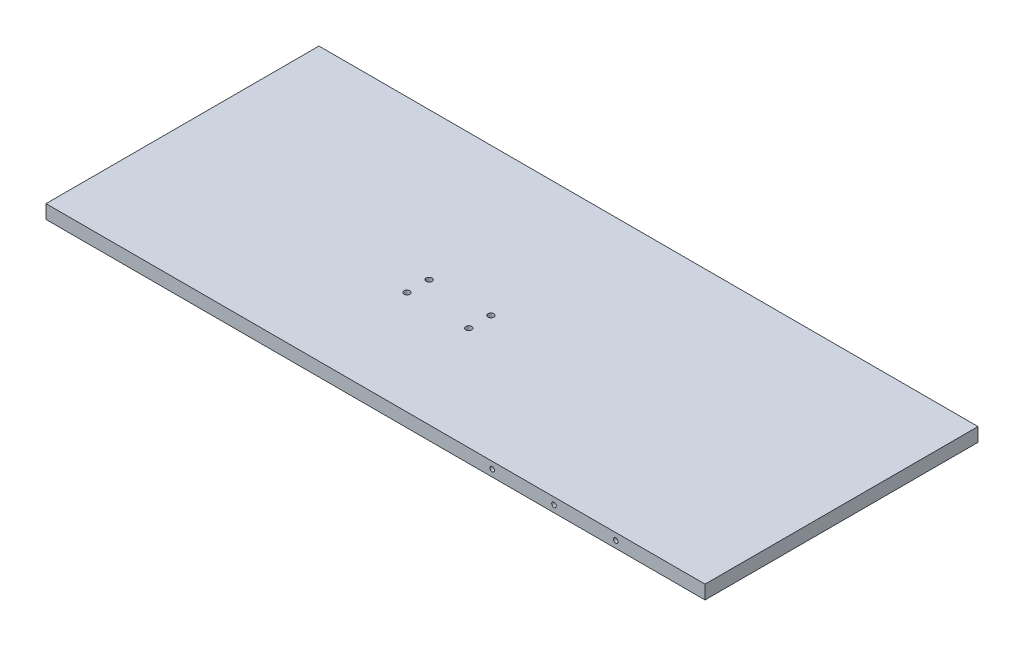
ISO-10303-21;
HEADER;
FILE_DESCRIPTION(('STEP AP214'),'2;1');
FILE_NAME('part.step','',(''),(''),'','','');
FILE_SCHEMA(('AUTOMOTIVE_DESIGN { 1 0 10303 214 1 1 1 1 }'));
ENDSEC;
DATA;
#1=APPLICATION_CONTEXT('core data for automotive mechanical design processes');
#2=APPLICATION_PROTOCOL_DEFINITION('international standard','automotive_design',2000,#1);
#3=PRODUCT_CONTEXT('',#1,'mechanical');
#4=PRODUCT('Part','Part','',(#3));
#5=PRODUCT_RELATED_PRODUCT_CATEGORY('part','',(#4));
#6=PRODUCT_DEFINITION_FORMATION('','',#4);
#7=PRODUCT_DEFINITION_CONTEXT('part definition',#1,'design');
#8=PRODUCT_DEFINITION('design','',#6,#7);
#9=PRODUCT_DEFINITION_SHAPE('','',#8);
#10=(LENGTH_UNIT() NAMED_UNIT(*) SI_UNIT(.MILLI.,.METRE.));
#11=(NAMED_UNIT(*) PLANE_ANGLE_UNIT() SI_UNIT($,.RADIAN.));
#12=(NAMED_UNIT(*) SI_UNIT($,.STERADIAN.) SOLID_ANGLE_UNIT());
#13=UNCERTAINTY_MEASURE_WITH_UNIT(LENGTH_MEASURE(1.E-05),#10,'distance_accuracy_value','');
#14=(GEOMETRIC_REPRESENTATION_CONTEXT(3) GLOBAL_UNCERTAINTY_ASSIGNED_CONTEXT((#13)) GLOBAL_UNIT_ASSIGNED_CONTEXT((#10,
#11,#12)) REPRESENTATION_CONTEXT('',''));
#15=CARTESIAN_POINT('',(0.,0.,0.));
#16=DIRECTION('',(0.,0.,1.));
#17=DIRECTION('',(1.,0.,0.));
#18=AXIS2_PLACEMENT_3D('',#15,#16,#17);
#19=CARTESIAN_POINT('',(0.,25.4,0.));
#20=DIRECTION('',(-1.,0.,0.));
#21=DIRECTION('',(0.,0.,1.));
#22=AXIS2_PLACEMENT_3D('',#19,#20,#21);
#23=PLANE('',#22);
#24=DIRECTION('',(0.,0.,-1.));
#25=VECTOR('',#24,1.);
#26=CARTESIAN_POINT('',(0.,0.,0.));
#27=LINE('',#26,#25);
#28=CARTESIAN_POINT('',(0.,0.,0.));
#29=VERTEX_POINT('',#28);
#30=CARTESIAN_POINT('',(0.,0.,-505.));
#31=VERTEX_POINT('',#30);
#32=EDGE_CURVE('E146',#29,#31,#27,.T.);
#33=ORIENTED_EDGE('',*,*,#32,.T.);
#34=DIRECTION('',(0.,-1.,0.));
#35=VECTOR('',#34,1.);
#36=CARTESIAN_POINT('',(0.,25.4,-505.));
#37=LINE('',#36,#35);
#38=CARTESIAN_POINT('',(0.,25.4,-505.));
#39=VERTEX_POINT('',#38);
#40=EDGE_CURVE('E11',#39,#31,#37,.T.);
#41=ORIENTED_EDGE('',*,*,#40,.F.);
#42=DIRECTION('',(0.,0.,-1.));
#43=VECTOR('',#42,1.);
#44=CARTESIAN_POINT('',(0.,25.4,0.));
#45=LINE('',#44,#43);
#46=CARTESIAN_POINT('',(0.,25.4,0.));
#47=VERTEX_POINT('',#46);
#48=EDGE_CURVE('E147',#47,#39,#45,.T.);
#49=ORIENTED_EDGE('',*,*,#48,.F.);
#50=DIRECTION('',(0.,-1.,0.));
#51=VECTOR('',#50,1.);
#52=CARTESIAN_POINT('',(0.,25.4,0.));
#53=LINE('',#52,#51);
#54=EDGE_CURVE('E153',#47,#29,#53,.T.);
#55=ORIENTED_EDGE('',*,*,#54,.T.);
#56=EDGE_LOOP('',(#33,#41,#49,#55));
#57=FACE_BOUND('',#56,.T.);
#58=ADVANCED_FACE('F33',(#57),#23,.F.);
#59=CARTESIAN_POINT('',(-1219.2,25.4,-505.));
#60=DIRECTION('',(0.,0.,1.));
#61=DIRECTION('',(1.,0.,0.));
#62=AXIS2_PLACEMENT_3D('',#59,#60,#61);
#63=PLANE('',#62);
#64=CARTESIAN_POINT('',(-165.1,12.7,-505.));
#65=DIRECTION('',(0.,0.,-1.));
#66=DIRECTION('',(-1.,0.,0.));
#67=AXIS2_PLACEMENT_3D('',#64,#65,#66);
#68=CIRCLE('',#67,4.24999999999998);
#69=CARTESIAN_POINT('',(-169.35,12.7,-505.));
#70=VERTEX_POINT('',#69);
#71=EDGE_CURVE('E110',#70,#70,#68,.T.);
#72=ORIENTED_EDGE('',*,*,#71,.F.);
#73=EDGE_LOOP('',(#72));
#74=FACE_BOUND('',#73,.T.);
#75=CARTESIAN_POINT('',(-279.4,12.7,-505.));
#76=DIRECTION('',(0.,0.,-1.));
#77=DIRECTION('',(-1.,0.,0.));
#78=AXIS2_PLACEMENT_3D('',#75,#76,#77);
#79=CIRCLE('',#78,4.24999999999998);
#80=CARTESIAN_POINT('',(-283.65,12.7,-505.));
#81=VERTEX_POINT('',#80);
#82=EDGE_CURVE('E109',#81,#81,#79,.T.);
#83=ORIENTED_EDGE('',*,*,#82,.F.);
#84=EDGE_LOOP('',(#83));
#85=FACE_BOUND('',#84,.T.);
#86=CARTESIAN_POINT('',(-393.7,12.7,-505.));
#87=DIRECTION('',(0.,0.,-1.));
#88=DIRECTION('',(-1.,0.,0.));
#89=AXIS2_PLACEMENT_3D('',#86,#87,#88);
#90=CIRCLE('',#89,4.24999999999998);
#91=CARTESIAN_POINT('',(-397.95,12.7,-505.));
#92=VERTEX_POINT('',#91);
#93=EDGE_CURVE('E122',#92,#92,#90,.T.);
#94=ORIENTED_EDGE('',*,*,#93,.F.);
#95=EDGE_LOOP('',(#94));
#96=FACE_BOUND('',#95,.T.);
#97=DIRECTION('',(-1.,0.,0.));
#98=VECTOR('',#97,1.);
#99=CARTESIAN_POINT('',(-1219.2,0.,-505.));
#100=LINE('',#99,#98);
#101=CARTESIAN_POINT('',(-1219.2,0.,-505.));
#102=VERTEX_POINT('',#101);
#103=EDGE_CURVE('E156',#31,#102,#100,.T.);
#104=ORIENTED_EDGE('',*,*,#103,.T.);
#105=DIRECTION('',(0.,-1.,0.));
#106=VECTOR('',#105,1.);
#107=CARTESIAN_POINT('',(-1219.2,25.4,-505.));
#108=LINE('',#107,#106);
#109=CARTESIAN_POINT('',(-1219.2,25.4,-505.));
#110=VERTEX_POINT('',#109);
#111=EDGE_CURVE('E41',#110,#102,#108,.T.);
#112=ORIENTED_EDGE('',*,*,#111,.F.);
#113=DIRECTION('',(-1.,0.,0.));
#114=VECTOR('',#113,1.);
#115=CARTESIAN_POINT('',(-1219.2,25.4,-505.));
#116=LINE('',#115,#114);
#117=EDGE_CURVE('E80',#39,#110,#116,.T.);
#118=ORIENTED_EDGE('',*,*,#117,.F.);
#119=ORIENTED_EDGE('',*,*,#40,.T.);
#120=EDGE_LOOP('',(#104,#112,#118,#119));
#121=FACE_BOUND('',#120,.T.);
#122=ADVANCED_FACE('F182',(#74,#85,#96,#121),#63,.F.);
#123=CARTESIAN_POINT('',(-1219.2,25.4,0.));
#124=DIRECTION('',(1.,0.,0.));
#125=DIRECTION('',(0.,0.,-1.));
#126=AXIS2_PLACEMENT_3D('',#123,#124,#125);
#127=PLANE('',#126);
#128=DIRECTION('',(0.,0.,1.));
#129=VECTOR('',#128,1.);
#130=CARTESIAN_POINT('',(-1219.2,0.,0.));
#131=LINE('',#130,#129);
#132=CARTESIAN_POINT('',(-1219.2,0.,0.));
#133=VERTEX_POINT('',#132);
#134=EDGE_CURVE('E67',#102,#133,#131,.T.);
#135=ORIENTED_EDGE('',*,*,#134,.T.);
#136=DIRECTION('',(0.,-1.,0.));
#137=VECTOR('',#136,1.);
#138=CARTESIAN_POINT('',(-1219.2,25.4,0.));
#139=LINE('',#138,#137);
#140=CARTESIAN_POINT('',(-1219.2,25.4,0.));
#141=VERTEX_POINT('',#140);
#142=EDGE_CURVE('E161',#141,#133,#139,.T.);
#143=ORIENTED_EDGE('',*,*,#142,.F.);
#144=DIRECTION('',(0.,0.,1.));
#145=VECTOR('',#144,1.);
#146=CARTESIAN_POINT('',(-1219.2,25.4,0.));
#147=LINE('',#146,#145);
#148=EDGE_CURVE('E150',#110,#141,#147,.T.);
#149=ORIENTED_EDGE('',*,*,#148,.F.);
#150=ORIENTED_EDGE('',*,*,#111,.T.);
#151=EDGE_LOOP('',(#135,#143,#149,#150));
#152=FACE_BOUND('',#151,.T.);
#153=ADVANCED_FACE('F163',(#152),#127,.F.);
#154=CARTESIAN_POINT('',(-1219.2,25.4,0.));
#155=DIRECTION('',(0.,0.,-1.));
#156=DIRECTION('',(-1.,0.,0.));
#157=AXIS2_PLACEMENT_3D('',#154,#155,#156);
#158=PLANE('',#157);
#159=CARTESIAN_POINT('',(-393.7,12.7,0.));
#160=DIRECTION('',(0.,0.,1.));
#161=DIRECTION('',(1.,0.,0.));
#162=AXIS2_PLACEMENT_3D('',#159,#160,#161);
#163=CIRCLE('',#162,4.24999999999998);
#164=CARTESIAN_POINT('',(-389.45,12.7,0.));
#165=VERTEX_POINT('',#164);
#166=EDGE_CURVE('E128',#165,#165,#163,.T.);
#167=ORIENTED_EDGE('',*,*,#166,.F.);
#168=EDGE_LOOP('',(#167));
#169=FACE_BOUND('',#168,.T.);
#170=CARTESIAN_POINT('',(-279.4,12.7,0.));
#171=DIRECTION('',(0.,0.,1.));
#172=DIRECTION('',(1.,0.,0.));
#173=AXIS2_PLACEMENT_3D('',#170,#171,#172);
#174=CIRCLE('',#173,4.24999999999998);
#175=CARTESIAN_POINT('',(-275.15,12.7,0.));
#176=VERTEX_POINT('',#175);
#177=EDGE_CURVE('E134',#176,#176,#174,.T.);
#178=ORIENTED_EDGE('',*,*,#177,.F.);
#179=EDGE_LOOP('',(#178));
#180=FACE_BOUND('',#179,.T.);
#181=CARTESIAN_POINT('',(-165.1,12.7,0.));
#182=DIRECTION('',(0.,0.,1.));
#183=DIRECTION('',(1.,0.,0.));
#184=AXIS2_PLACEMENT_3D('',#181,#182,#183);
#185=CIRCLE('',#184,4.25);
#186=CARTESIAN_POINT('',(-160.85,12.7,0.));
#187=VERTEX_POINT('',#186);
#188=EDGE_CURVE('E140',#187,#187,#185,.T.);
#189=ORIENTED_EDGE('',*,*,#188,.F.);
#190=EDGE_LOOP('',(#189));
#191=FACE_BOUND('',#190,.T.);
#192=DIRECTION('',(1.,0.,0.));
#193=VECTOR('',#192,1.);
#194=CARTESIAN_POINT('',(-1219.2,0.,0.));
#195=LINE('',#194,#193);
#196=EDGE_CURVE('E73',#133,#29,#195,.T.);
#197=ORIENTED_EDGE('',*,*,#196,.T.);
#198=ORIENTED_EDGE('',*,*,#54,.F.);
#199=DIRECTION('',(1.,0.,0.));
#200=VECTOR('',#199,1.);
#201=CARTESIAN_POINT('',(-1219.2,25.4,0.));
#202=LINE('',#201,#200);
#203=EDGE_CURVE('E49',#141,#47,#202,.T.);
#204=ORIENTED_EDGE('',*,*,#203,.F.);
#205=ORIENTED_EDGE('',*,*,#142,.T.);
#206=EDGE_LOOP('',(#197,#198,#204,#205));
#207=FACE_BOUND('',#206,.T.);
#208=ADVANCED_FACE('F170',(#169,#180,#191,#207),#158,.F.);
#209=CARTESIAN_POINT('',(0.,25.4,0.));
#210=DIRECTION('',(0.,-1.,0.));
#211=DIRECTION('',(0.,0.,-1.));
#212=AXIS2_PLACEMENT_3D('',#209,#210,#211);
#213=PLANE('',#212);
#214=CARTESIAN_POINT('',(-628.6,25.4,-191.600000000001));
#215=DIRECTION('',(0.,1.,0.));
#216=DIRECTION('',(0.,0.,1.));
#217=AXIS2_PLACEMENT_3D('',#214,#215,#216);
#218=CIRCLE('',#217,5.49999999999995);
#219=CARTESIAN_POINT('',(-628.6,25.4,-186.100000000001));
#220=VERTEX_POINT('',#219);
#221=EDGE_CURVE('E273',#220,#220,#218,.T.);
#222=ORIENTED_EDGE('',*,*,#221,.F.);
#223=EDGE_LOOP('',(#222));
#224=FACE_BOUND('',#223,.T.);
#225=CARTESIAN_POINT('',(-628.6,25.4,-232.500000000001));
#226=DIRECTION('',(0.,1.,0.));
#227=DIRECTION('',(0.,0.,1.));
#228=AXIS2_PLACEMENT_3D('',#225,#226,#227);
#229=CIRCLE('',#228,5.49999999999995);
#230=CARTESIAN_POINT('',(-628.6,25.4,-227.000000000001));
#231=VERTEX_POINT('',#230);
#232=EDGE_CURVE('E269',#231,#231,#229,.T.);
#233=ORIENTED_EDGE('',*,*,#232,.F.);
#234=EDGE_LOOP('',(#233));
#235=FACE_BOUND('',#234,.T.);
#236=CARTESIAN_POINT('',(-743.,25.4,-232.500000000001));
#237=DIRECTION('',(0.,1.,0.));
#238=DIRECTION('',(0.,0.,1.));
#239=AXIS2_PLACEMENT_3D('',#236,#237,#238);
#240=CIRCLE('',#239,5.49999999999995);
#241=CARTESIAN_POINT('',(-743.,25.4,-227.000000000001));
#242=VERTEX_POINT('',#241);
#243=EDGE_CURVE('E265',#242,#242,#240,.T.);
#244=ORIENTED_EDGE('',*,*,#243,.F.);
#245=EDGE_LOOP('',(#244));
#246=FACE_BOUND('',#245,.T.);
#247=CARTESIAN_POINT('',(-743.,25.4,-191.600000000001));
#248=DIRECTION('',(0.,1.,0.));
#249=DIRECTION('',(0.,0.,1.));
#250=AXIS2_PLACEMENT_3D('',#247,#248,#249);
#251=CIRCLE('',#250,5.49999999999995);
#252=CARTESIAN_POINT('',(-743.,25.4,-186.100000000001));
#253=VERTEX_POINT('',#252);
#254=EDGE_CURVE('E260',#253,#253,#251,.T.);
#255=ORIENTED_EDGE('',*,*,#254,.F.);
#256=EDGE_LOOP('',(#255));
#257=FACE_BOUND('',#256,.T.);
#258=ORIENTED_EDGE('',*,*,#48,.T.);
#259=ORIENTED_EDGE('',*,*,#117,.T.);
#260=ORIENTED_EDGE('',*,*,#148,.T.);
#261=ORIENTED_EDGE('',*,*,#203,.T.);
#262=EDGE_LOOP('',(#258,#259,#260,#261));
#263=FACE_BOUND('',#262,.T.);
#264=ADVANCED_FACE('F172',(#224,#235,#246,#257,#263),#213,.F.);
#265=CARTESIAN_POINT('',(0.,0.,0.));
#266=DIRECTION('',(0.,-1.,0.));
#267=DIRECTION('',(0.,0.,-1.));
#268=AXIS2_PLACEMENT_3D('',#265,#266,#267);
#269=PLANE('',#268);
#270=CARTESIAN_POINT('',(-628.6,0.,-191.600000000001));
#271=DIRECTION('',(0.,1.,0.));
#272=DIRECTION('',(0.,0.,1.));
#273=AXIS2_PLACEMENT_3D('',#270,#271,#272);
#274=CIRCLE('',#273,5.49999999999995);
#275=CARTESIAN_POINT('',(-628.6,0.,-186.100000000001));
#276=VERTEX_POINT('',#275);
#277=EDGE_CURVE('E248',#276,#276,#274,.T.);
#278=ORIENTED_EDGE('',*,*,#277,.T.);
#279=EDGE_LOOP('',(#278));
#280=FACE_BOUND('',#279,.T.);
#281=CARTESIAN_POINT('',(-628.6,0.,-232.500000000001));
#282=DIRECTION('',(0.,1.,0.));
#283=DIRECTION('',(0.,0.,1.));
#284=AXIS2_PLACEMENT_3D('',#281,#282,#283);
#285=CIRCLE('',#284,5.49999999999995);
#286=CARTESIAN_POINT('',(-628.6,0.,-227.000000000001));
#287=VERTEX_POINT('',#286);
#288=EDGE_CURVE('E252',#287,#287,#285,.T.);
#289=ORIENTED_EDGE('',*,*,#288,.T.);
#290=EDGE_LOOP('',(#289));
#291=FACE_BOUND('',#290,.T.);
#292=CARTESIAN_POINT('',(-743.,0.,-232.500000000001));
#293=DIRECTION('',(0.,1.,0.));
#294=DIRECTION('',(0.,0.,1.));
#295=AXIS2_PLACEMENT_3D('',#292,#293,#294);
#296=CIRCLE('',#295,5.49999999999995);
#297=CARTESIAN_POINT('',(-743.,0.,-227.000000000001));
#298=VERTEX_POINT('',#297);
#299=EDGE_CURVE('E256',#298,#298,#296,.T.);
#300=ORIENTED_EDGE('',*,*,#299,.T.);
#301=EDGE_LOOP('',(#300));
#302=FACE_BOUND('',#301,.T.);
#303=CARTESIAN_POINT('',(-743.,0.,-191.600000000001));
#304=DIRECTION('',(0.,1.,0.));
#305=DIRECTION('',(0.,0.,1.));
#306=AXIS2_PLACEMENT_3D('',#303,#304,#305);
#307=CIRCLE('',#306,5.49999999999995);
#308=CARTESIAN_POINT('',(-743.,0.,-186.100000000001));
#309=VERTEX_POINT('',#308);
#310=EDGE_CURVE('E116',#309,#309,#307,.T.);
#311=ORIENTED_EDGE('',*,*,#310,.T.);
#312=EDGE_LOOP('',(#311));
#313=FACE_BOUND('',#312,.T.);
#314=ORIENTED_EDGE('',*,*,#32,.F.);
#315=ORIENTED_EDGE('',*,*,#196,.F.);
#316=ORIENTED_EDGE('',*,*,#134,.F.);
#317=ORIENTED_EDGE('',*,*,#103,.F.);
#318=EDGE_LOOP('',(#314,#315,#316,#317));
#319=FACE_BOUND('',#318,.T.);
#320=ADVANCED_FACE('F166',(#280,#291,#302,#313,#319),#269,.T.);
#321=CARTESIAN_POINT('',(-165.1,12.7,-20.));
#322=DIRECTION('',(0.,0.,1.));
#323=DIRECTION('',(1.,0.,0.));
#324=AXIS2_PLACEMENT_3D('',#321,#322,#323);
#325=CONICAL_SURFACE('',#324,4.25,1.02974425867665);
#326=CARTESIAN_POINT('',(-165.1,12.7,-22.5536576308671));
#327=VERTEX_POINT('',#326);
#328=VERTEX_LOOP('',#327);
#329=FACE_BOUND('',#328,.T.);
#330=CARTESIAN_POINT('',(-165.1,12.7,-20.));
#331=DIRECTION('',(0.,0.,1.));
#332=DIRECTION('',(1.,0.,0.));
#333=AXIS2_PLACEMENT_3D('',#330,#331,#332);
#334=CIRCLE('',#333,4.25);
#335=CARTESIAN_POINT('',(-160.85,12.7,-20.));
#336=VERTEX_POINT('',#335);
#337=EDGE_CURVE('E143',#336,#336,#334,.T.);
#338=ORIENTED_EDGE('',*,*,#337,.T.);
#339=EDGE_LOOP('',(#338));
#340=FACE_BOUND('',#339,.T.);
#341=ADVANCED_FACE('F236',(#329,#340),#325,.F.);
#342=CARTESIAN_POINT('',(-165.1,12.7,0.));
#343=DIRECTION('',(0.,0.,1.));
#344=DIRECTION('',(1.,0.,0.));
#345=AXIS2_PLACEMENT_3D('',#342,#343,#344);
#346=CYLINDRICAL_SURFACE('',#345,4.25);
#347=ORIENTED_EDGE('',*,*,#337,.F.);
#348=EDGE_LOOP('',(#347));
#349=FACE_BOUND('',#348,.T.);
#350=ORIENTED_EDGE('',*,*,#188,.T.);
#351=EDGE_LOOP('',(#350));
#352=FACE_BOUND('',#351,.T.);
#353=ADVANCED_FACE('F232',(#349,#352),#346,.F.);
#354=CARTESIAN_POINT('',(-279.4,12.7,-20.));
#355=DIRECTION('',(0.,0.,1.));
#356=DIRECTION('',(1.,0.,0.));
#357=AXIS2_PLACEMENT_3D('',#354,#355,#356);
#358=CONICAL_SURFACE('',#357,4.24999999999998,1.02974425867665);
#359=CARTESIAN_POINT('',(-279.4,12.7,-22.5536576308671));
#360=VERTEX_POINT('',#359);
#361=VERTEX_LOOP('',#360);
#362=FACE_BOUND('',#361,.T.);
#363=CARTESIAN_POINT('',(-279.4,12.7,-20.));
#364=DIRECTION('',(0.,0.,1.));
#365=DIRECTION('',(1.,0.,0.));
#366=AXIS2_PLACEMENT_3D('',#363,#364,#365);
#367=CIRCLE('',#366,4.24999999999998);
#368=CARTESIAN_POINT('',(-275.15,12.7,-20.));
#369=VERTEX_POINT('',#368);
#370=EDGE_CURVE('E137',#369,#369,#367,.T.);
#371=ORIENTED_EDGE('',*,*,#370,.T.);
#372=EDGE_LOOP('',(#371));
#373=FACE_BOUND('',#372,.T.);
#374=ADVANCED_FACE('F228',(#362,#373),#358,.F.);
#375=CARTESIAN_POINT('',(-279.4,12.7,0.));
#376=DIRECTION('',(0.,0.,1.));
#377=DIRECTION('',(1.,0.,0.));
#378=AXIS2_PLACEMENT_3D('',#375,#376,#377);
#379=CYLINDRICAL_SURFACE('',#378,4.24999999999998);
#380=ORIENTED_EDGE('',*,*,#370,.F.);
#381=EDGE_LOOP('',(#380));
#382=FACE_BOUND('',#381,.T.);
#383=ORIENTED_EDGE('',*,*,#177,.T.);
#384=EDGE_LOOP('',(#383));
#385=FACE_BOUND('',#384,.T.);
#386=ADVANCED_FACE('F224',(#382,#385),#379,.F.);
#387=CARTESIAN_POINT('',(-393.7,12.7,-20.));
#388=DIRECTION('',(0.,0.,1.));
#389=DIRECTION('',(1.,0.,0.));
#390=AXIS2_PLACEMENT_3D('',#387,#388,#389);
#391=CONICAL_SURFACE('',#390,4.24999999999998,1.02974425867665);
#392=CARTESIAN_POINT('',(-393.7,12.7,-22.5536576308671));
#393=VERTEX_POINT('',#392);
#394=VERTEX_LOOP('',#393);
#395=FACE_BOUND('',#394,.T.);
#396=CARTESIAN_POINT('',(-393.7,12.7,-20.));
#397=DIRECTION('',(0.,0.,1.));
#398=DIRECTION('',(1.,0.,0.));
#399=AXIS2_PLACEMENT_3D('',#396,#397,#398);
#400=CIRCLE('',#399,4.24999999999998);
#401=CARTESIAN_POINT('',(-389.45,12.7,-20.));
#402=VERTEX_POINT('',#401);
#403=EDGE_CURVE('E131',#402,#402,#400,.T.);
#404=ORIENTED_EDGE('',*,*,#403,.T.);
#405=EDGE_LOOP('',(#404));
#406=FACE_BOUND('',#405,.T.);
#407=ADVANCED_FACE('F220',(#395,#406),#391,.F.);
#408=CARTESIAN_POINT('',(-393.7,12.7,0.));
#409=DIRECTION('',(0.,0.,1.));
#410=DIRECTION('',(1.,0.,0.));
#411=AXIS2_PLACEMENT_3D('',#408,#409,#410);
#412=CYLINDRICAL_SURFACE('',#411,4.24999999999998);
#413=ORIENTED_EDGE('',*,*,#403,.F.);
#414=EDGE_LOOP('',(#413));
#415=FACE_BOUND('',#414,.T.);
#416=ORIENTED_EDGE('',*,*,#166,.T.);
#417=EDGE_LOOP('',(#416));
#418=FACE_BOUND('',#417,.T.);
#419=ADVANCED_FACE('F212',(#415,#418),#412,.F.);
#420=CARTESIAN_POINT('',(-393.7,12.7,-485.));
#421=DIRECTION('',(0.,0.,-1.));
#422=DIRECTION('',(-1.,0.,0.));
#423=AXIS2_PLACEMENT_3D('',#420,#421,#422);
#424=CONICAL_SURFACE('',#423,4.24999999999998,1.02974425867665);
#425=CARTESIAN_POINT('',(-393.7,12.7,-482.446342369133));
#426=VERTEX_POINT('',#425);
#427=VERTEX_LOOP('',#426);
#428=FACE_BOUND('',#427,.T.);
#429=CARTESIAN_POINT('',(-393.7,12.7,-485.));
#430=DIRECTION('',(0.,0.,-1.));
#431=DIRECTION('',(-1.,0.,0.));
#432=AXIS2_PLACEMENT_3D('',#429,#430,#431);
#433=CIRCLE('',#432,4.24999999999998);
#434=CARTESIAN_POINT('',(-397.95,12.7,-485.));
#435=VERTEX_POINT('',#434);
#436=EDGE_CURVE('E125',#435,#435,#433,.T.);
#437=ORIENTED_EDGE('',*,*,#436,.T.);
#438=EDGE_LOOP('',(#437));
#439=FACE_BOUND('',#438,.T.);
#440=ADVANCED_FACE('F203',(#428,#439),#424,.F.);
#441=CARTESIAN_POINT('',(-393.7,12.7,-505.));
#442=DIRECTION('',(0.,0.,-1.));
#443=DIRECTION('',(-1.,0.,0.));
#444=AXIS2_PLACEMENT_3D('',#441,#442,#443);
#445=CYLINDRICAL_SURFACE('',#444,4.24999999999998);
#446=ORIENTED_EDGE('',*,*,#436,.F.);
#447=EDGE_LOOP('',(#446));
#448=FACE_BOUND('',#447,.T.);
#449=ORIENTED_EDGE('',*,*,#93,.T.);
#450=EDGE_LOOP('',(#449));
#451=FACE_BOUND('',#450,.T.);
#452=ADVANCED_FACE('F200',(#448,#451),#445,.F.);
#453=CARTESIAN_POINT('',(-279.4,12.7,-485.));
#454=DIRECTION('',(0.,0.,-1.));
#455=DIRECTION('',(-1.,0.,0.));
#456=AXIS2_PLACEMENT_3D('',#453,#454,#455);
#457=CONICAL_SURFACE('',#456,4.24999999999998,1.02974425867665);
#458=CARTESIAN_POINT('',(-279.4,12.7,-482.446342369133));
#459=VERTEX_POINT('',#458);
#460=VERTEX_LOOP('',#459);
#461=FACE_BOUND('',#460,.T.);
#462=CARTESIAN_POINT('',(-279.4,12.7,-485.));
#463=DIRECTION('',(0.,0.,-1.));
#464=DIRECTION('',(-1.,0.,0.));
#465=AXIS2_PLACEMENT_3D('',#462,#463,#464);
#466=CIRCLE('',#465,4.24999999999998);
#467=CARTESIAN_POINT('',(-283.65,12.7,-485.));
#468=VERTEX_POINT('',#467);
#469=EDGE_CURVE('E113',#468,#468,#466,.T.);
#470=ORIENTED_EDGE('',*,*,#469,.T.);
#471=EDGE_LOOP('',(#470));
#472=FACE_BOUND('',#471,.T.);
#473=ADVANCED_FACE('F202',(#461,#472),#457,.F.);
#474=CARTESIAN_POINT('',(-279.4,12.7,-505.));
#475=DIRECTION('',(0.,0.,-1.));
#476=DIRECTION('',(-1.,0.,0.));
#477=AXIS2_PLACEMENT_3D('',#474,#475,#476);
#478=CYLINDRICAL_SURFACE('',#477,4.24999999999998);
#479=ORIENTED_EDGE('',*,*,#469,.F.);
#480=EDGE_LOOP('',(#479));
#481=FACE_BOUND('',#480,.T.);
#482=ORIENTED_EDGE('',*,*,#82,.T.);
#483=EDGE_LOOP('',(#482));
#484=FACE_BOUND('',#483,.T.);
#485=ADVANCED_FACE('F103',(#481,#484),#478,.F.);
#486=CARTESIAN_POINT('',(-165.1,12.7,-485.));
#487=DIRECTION('',(0.,0.,-1.));
#488=DIRECTION('',(-1.,0.,0.));
#489=AXIS2_PLACEMENT_3D('',#486,#487,#488);
#490=CONICAL_SURFACE('',#489,4.24999999999998,1.02974425867665);
#491=CARTESIAN_POINT('',(-165.1,12.7,-482.446342369133));
#492=VERTEX_POINT('',#491);
#493=VERTEX_LOOP('',#492);
#494=FACE_BOUND('',#493,.T.);
#495=CARTESIAN_POINT('',(-165.1,12.7,-485.));
#496=DIRECTION('',(0.,0.,-1.));
#497=DIRECTION('',(-1.,0.,0.));
#498=AXIS2_PLACEMENT_3D('',#495,#496,#497);
#499=CIRCLE('',#498,4.24999999999998);
#500=CARTESIAN_POINT('',(-169.35,12.7,-485.));
#501=VERTEX_POINT('',#500);
#502=EDGE_CURVE('E107',#501,#501,#499,.T.);
#503=ORIENTED_EDGE('',*,*,#502,.T.);
#504=EDGE_LOOP('',(#503));
#505=FACE_BOUND('',#504,.T.);
#506=ADVANCED_FACE('F99',(#494,#505),#490,.F.);
#507=CARTESIAN_POINT('',(-165.1,12.7,-505.));
#508=DIRECTION('',(0.,0.,-1.));
#509=DIRECTION('',(-1.,0.,0.));
#510=AXIS2_PLACEMENT_3D('',#507,#508,#509);
#511=CYLINDRICAL_SURFACE('',#510,4.24999999999998);
#512=ORIENTED_EDGE('',*,*,#502,.F.);
#513=EDGE_LOOP('',(#512));
#514=FACE_BOUND('',#513,.T.);
#515=ORIENTED_EDGE('',*,*,#71,.T.);
#516=EDGE_LOOP('',(#515));
#517=FACE_BOUND('',#516,.T.);
#518=ADVANCED_FACE('F102',(#514,#517),#511,.F.);
#519=CARTESIAN_POINT('',(-743.,25.4,-191.600000000001));
#520=DIRECTION('',(0.,1.,0.));
#521=DIRECTION('',(0.,0.,1.));
#522=AXIS2_PLACEMENT_3D('',#519,#520,#521);
#523=CYLINDRICAL_SURFACE('',#522,5.49999999999995);
#524=ORIENTED_EDGE('',*,*,#310,.F.);
#525=EDGE_LOOP('',(#524));
#526=FACE_BOUND('',#525,.T.);
#527=ORIENTED_EDGE('',*,*,#254,.T.);
#528=EDGE_LOOP('',(#527));
#529=FACE_BOUND('',#528,.T.);
#530=ADVANCED_FACE('F285',(#526,#529),#523,.F.);
#531=CARTESIAN_POINT('',(-743.,25.4,-232.500000000001));
#532=DIRECTION('',(0.,1.,0.));
#533=DIRECTION('',(0.,0.,1.));
#534=AXIS2_PLACEMENT_3D('',#531,#532,#533);
#535=CYLINDRICAL_SURFACE('',#534,5.49999999999995);
#536=ORIENTED_EDGE('',*,*,#299,.F.);
#537=EDGE_LOOP('',(#536));
#538=FACE_BOUND('',#537,.T.);
#539=ORIENTED_EDGE('',*,*,#243,.T.);
#540=EDGE_LOOP('',(#539));
#541=FACE_BOUND('',#540,.T.);
#542=ADVANCED_FACE('F287',(#538,#541),#535,.F.);
#543=CARTESIAN_POINT('',(-628.6,25.4,-232.500000000001));
#544=DIRECTION('',(0.,1.,0.));
#545=DIRECTION('',(0.,0.,1.));
#546=AXIS2_PLACEMENT_3D('',#543,#544,#545);
#547=CYLINDRICAL_SURFACE('',#546,5.49999999999995);
#548=ORIENTED_EDGE('',*,*,#288,.F.);
#549=EDGE_LOOP('',(#548));
#550=FACE_BOUND('',#549,.T.);
#551=ORIENTED_EDGE('',*,*,#232,.T.);
#552=EDGE_LOOP('',(#551));
#553=FACE_BOUND('',#552,.T.);
#554=ADVANCED_FACE('F292',(#550,#553),#547,.F.);
#555=CARTESIAN_POINT('',(-628.6,25.4,-191.600000000001));
#556=DIRECTION('',(0.,1.,0.));
#557=DIRECTION('',(0.,0.,1.));
#558=AXIS2_PLACEMENT_3D('',#555,#556,#557);
#559=CYLINDRICAL_SURFACE('',#558,5.49999999999995);
#560=ORIENTED_EDGE('',*,*,#277,.F.);
#561=EDGE_LOOP('',(#560));
#562=FACE_BOUND('',#561,.T.);
#563=ORIENTED_EDGE('',*,*,#221,.T.);
#564=EDGE_LOOP('',(#563));
#565=FACE_BOUND('',#564,.T.);
#566=ADVANCED_FACE('F277',(#562,#565),#559,.F.);
#567=CLOSED_SHELL('',(#58,#122,#153,#208,#264,#320,#341,#353,#374,#386,#407,#419,#440,#452,#473,
#485,#506,#518,#530,#542,#554,#566));
#568=MANIFOLD_SOLID_BREP('B2',#567);
#569=ADVANCED_BREP_SHAPE_REPRESENTATION('',(#18,#568),#14);
#570=SHAPE_DEFINITION_REPRESENTATION(#9,#569);
ENDSEC;
END-ISO-10303-21;
